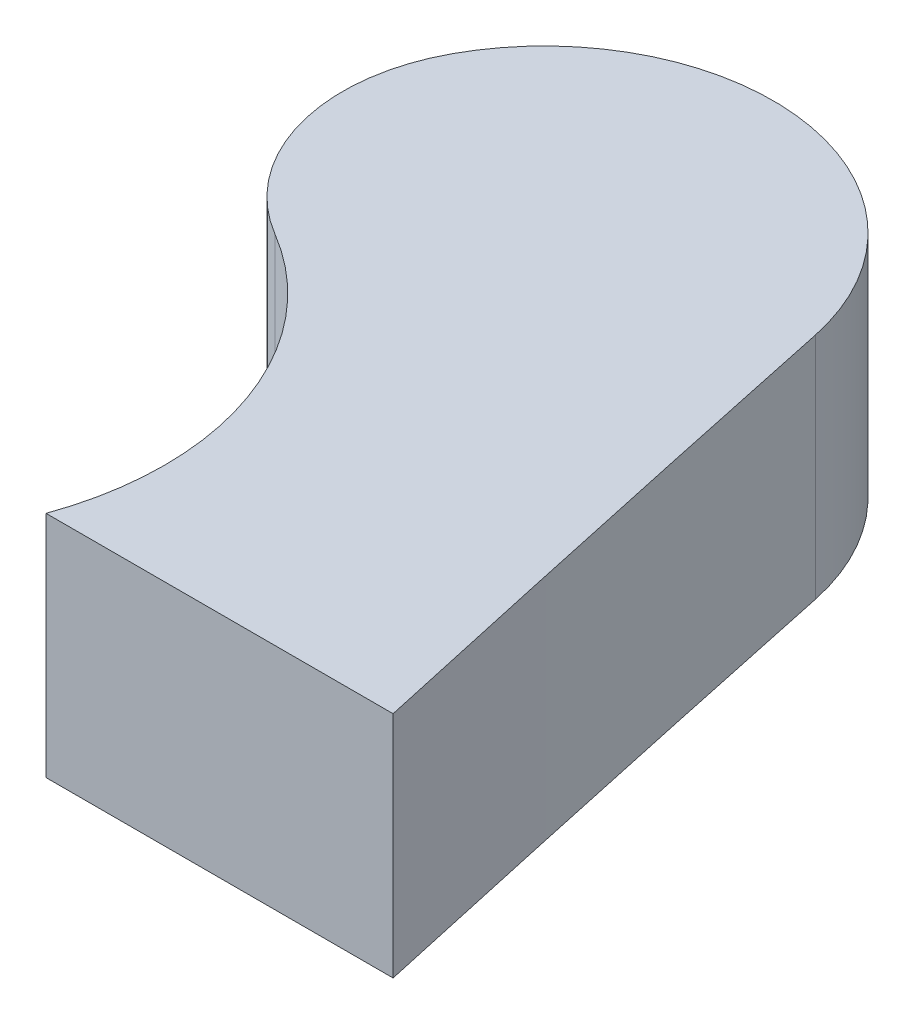
ISO-10303-21;
HEADER;
FILE_DESCRIPTION(('STEP AP214'),'2;1');
FILE_NAME('part.step','',(''),(''),'','','');
FILE_SCHEMA(('AUTOMOTIVE_DESIGN { 1 0 10303 214 1 1 1 1 }'));
ENDSEC;
DATA;
#1=APPLICATION_CONTEXT('core data for automotive mechanical design processes');
#2=APPLICATION_PROTOCOL_DEFINITION('international standard','automotive_design',2000,#1);
#3=PRODUCT_CONTEXT('',#1,'mechanical');
#4=PRODUCT('Part','Part','',(#3));
#5=PRODUCT_RELATED_PRODUCT_CATEGORY('part','',(#4));
#6=PRODUCT_DEFINITION_FORMATION('','',#4);
#7=PRODUCT_DEFINITION_CONTEXT('part definition',#1,'design');
#8=PRODUCT_DEFINITION('design','',#6,#7);
#9=PRODUCT_DEFINITION_SHAPE('','',#8);
#10=(LENGTH_UNIT() NAMED_UNIT(*) SI_UNIT(.MILLI.,.METRE.));
#11=(NAMED_UNIT(*) PLANE_ANGLE_UNIT() SI_UNIT($,.RADIAN.));
#12=(NAMED_UNIT(*) SI_UNIT($,.STERADIAN.) SOLID_ANGLE_UNIT());
#13=UNCERTAINTY_MEASURE_WITH_UNIT(LENGTH_MEASURE(1.E-05),#10,'distance_accuracy_value','');
#14=(GEOMETRIC_REPRESENTATION_CONTEXT(3) GLOBAL_UNCERTAINTY_ASSIGNED_CONTEXT((#13)) GLOBAL_UNIT_ASSIGNED_CONTEXT((#10,
#11,#12)) REPRESENTATION_CONTEXT('',''));
#15=CARTESIAN_POINT('',(0.,0.,0.));
#16=DIRECTION('',(0.,0.,1.));
#17=DIRECTION('',(1.,0.,0.));
#18=AXIS2_PLACEMENT_3D('',#15,#16,#17);
#19=CARTESIAN_POINT('',(0.,-71.0000047683717,-2.20684642442516E-13));
#20=DIRECTION('',(0.,1.,0.));
#21=DIRECTION('',(0.,0.,1.));
#22=AXIS2_PLACEMENT_3D('',#19,#20,#21);
#23=PLANE('',#22);
#24=DIRECTION('',(-1.,0.,0.));
#25=VECTOR('',#24,1.);
#26=CARTESIAN_POINT('',(2.01227923213309E-13,-71.0000047677994,-11.2500000000002));
#27=LINE('',#26,#25);
#28=CARTESIAN_POINT('',(7.44528645186782,-71.0000047677994,-11.2500000000003));
#29=VERTEX_POINT('',#28);
#30=CARTESIAN_POINT('',(-0.136071323830463,-71.0000047677988,-11.2500000000002));
#31=VERTEX_POINT('',#30);
#32=EDGE_CURVE('E60',#29,#31,#27,.T.);
#33=ORIENTED_EDGE('',*,*,#32,.T.);
#34=CARTESIAN_POINT('',(-6.2513343960096,-71.0000047677982,-13.4530791084396));
#35=DIRECTION('',(0.,1.,0.));
#36=DIRECTION('',(0.,0.,1.));
#37=AXIS2_PLACEMENT_3D('',#34,#35,#36);
#38=CIRCLE('',#37,6.5);
#39=CARTESIAN_POINT('',(-2.9261639666031,-71.0000047677983,-19.0381701207151));
#40=VERTEX_POINT('',#39);
#41=EDGE_CURVE('E20',#31,#40,#38,.T.);
#42=ORIENTED_EDGE('',*,*,#41,.T.);
#43=CARTESIAN_POINT('',(-0.879905240811327,-71.0000047677983,-22.4751492051904));
#44=DIRECTION('',(0.,1.,0.));
#45=DIRECTION('',(0.,0.,1.));
#46=AXIS2_PLACEMENT_3D('',#43,#44,#45);
#47=CIRCLE('',#46,4.);
#48=CARTESIAN_POINT('',(-4.39952620405566,-71.0000047677965,-24.3757460259525));
#49=VERTEX_POINT('',#48);
#50=EDGE_CURVE('E66',#49,#40,#47,.T.);
#51=ORIENTED_EDGE('',*,*,#50,.F.);
#52=CARTESIAN_POINT('',(-1.46471064301715E-13,-71.0000047677995,-22.));
#53=DIRECTION('',(0.,1.,0.));
#54=DIRECTION('',(0.,0.,1.));
#55=AXIS2_PLACEMENT_3D('',#52,#53,#54);
#56=CIRCLE('',#55,5.);
#57=CARTESIAN_POINT('',(4.89237093813955,-71.0000047677995,-23.0318462112329));
#58=VERTEX_POINT('',#57);
#59=EDGE_CURVE('E80',#58,#49,#56,.T.);
#60=ORIENTED_EDGE('',*,*,#59,.F.);
#61=CARTESIAN_POINT('',(1078.76136556438,-71.000004767803,-249.552556918456));
#62=DIRECTION('',(0.,1.,0.));
#63=DIRECTION('',(0.,0.,1.));
#64=AXIS2_PLACEMENT_3D('',#61,#62,#63);
#65=CIRCLE('',#64,1097.49999999949);
#66=EDGE_CURVE('E94',#58,#29,#65,.T.);
#67=ORIENTED_EDGE('',*,*,#66,.T.);
#68=EDGE_LOOP('',(#33,#42,#51,#60,#67));
#69=FACE_BOUND('',#68,.T.);
#70=ADVANCED_FACE('F17',(#69),#23,.F.);
#71=CARTESIAN_POINT('',(2.01227923213309E-13,-30.5433363392091,-11.2500000000001));
#72=DIRECTION('',(0.,0.,-1.));
#73=DIRECTION('',(-1.,0.,0.));
#74=AXIS2_PLACEMENT_3D('',#71,#72,#73);
#75=PLANE('',#74);
#76=DIRECTION('',(1.,0.,0.));
#77=VECTOR('',#76,1.);
#78=CARTESIAN_POINT('',(0.,-66.,-11.2500000000002));
#79=LINE('',#78,#77);
#80=CARTESIAN_POINT('',(7.44528645186771,-66.0000000000001,-11.2500000000004));
#81=VERTEX_POINT('',#80);
#82=CARTESIAN_POINT('',(-0.136071323830467,-66.,-11.2500000000002));
#83=VERTEX_POINT('',#82);
#84=EDGE_CURVE('E93',#81,#83,#79,.F.);
#85=ORIENTED_EDGE('',*,*,#84,.T.);
#86=DIRECTION('',(0.,1.,0.));
#87=VECTOR('',#86,1.);
#88=CARTESIAN_POINT('',(-0.136071323830452,-70.999999046326,-11.2500000000002));
#89=LINE('',#88,#87);
#90=EDGE_CURVE('E75',#83,#31,#89,.F.);
#91=ORIENTED_EDGE('',*,*,#90,.T.);
#92=ORIENTED_EDGE('',*,*,#32,.F.);
#93=DIRECTION('',(0.,1.,0.));
#94=VECTOR('',#93,1.);
#95=CARTESIAN_POINT('',(7.44528645186771,-70.999999046326,-11.2500000000005));
#96=LINE('',#95,#94);
#97=EDGE_CURVE('E95',#29,#81,#96,.T.);
#98=ORIENTED_EDGE('',*,*,#97,.T.);
#99=EDGE_LOOP('',(#85,#91,#92,#98));
#100=FACE_BOUND('',#99,.T.);
#101=ADVANCED_FACE('F103',(#100),#75,.F.);
#102=CARTESIAN_POINT('',(-6.2513343960096,-70.999999046326,-13.4530791084396));
#103=DIRECTION('',(0.,1.,0.));
#104=DIRECTION('',(0.,0.,1.));
#105=AXIS2_PLACEMENT_3D('',#102,#103,#104);
#106=CYLINDRICAL_SURFACE('',#105,6.5);
#107=ORIENTED_EDGE('',*,*,#90,.F.);
#108=CARTESIAN_POINT('',(-6.2513343960096,-65.9999999999999,-13.4530791084397));
#109=DIRECTION('',(0.,1.,0.));
#110=DIRECTION('',(0.,0.,1.));
#111=AXIS2_PLACEMENT_3D('',#108,#109,#110);
#112=CIRCLE('',#111,6.5);
#113=CARTESIAN_POINT('',(-2.9261639666031,-66.,-19.0381701207151));
#114=VERTEX_POINT('',#113);
#115=EDGE_CURVE('E79',#83,#114,#112,.T.);
#116=ORIENTED_EDGE('',*,*,#115,.T.);
#117=DIRECTION('',(0.,1.,0.));
#118=VECTOR('',#117,1.);
#119=CARTESIAN_POINT('',(-2.92616396660506,-70.9999990463261,-19.0381701207162));
#120=LINE('',#119,#118);
#121=EDGE_CURVE('E70',#40,#114,#120,.T.);
#122=ORIENTED_EDGE('',*,*,#121,.F.);
#123=ORIENTED_EDGE('',*,*,#41,.F.);
#124=EDGE_LOOP('',(#107,#116,#122,#123));
#125=FACE_BOUND('',#124,.T.);
#126=ADVANCED_FACE('F77',(#125),#106,.F.);
#127=CARTESIAN_POINT('',(-0.879905240811327,-70.9999990463261,-22.4751492051904));
#128=DIRECTION('',(0.,1.,0.));
#129=DIRECTION('',(0.,0.,1.));
#130=AXIS2_PLACEMENT_3D('',#127,#128,#129);
#131=CYLINDRICAL_SURFACE('',#130,4.);
#132=ORIENTED_EDGE('',*,*,#50,.T.);
#133=ORIENTED_EDGE('',*,*,#121,.T.);
#134=CARTESIAN_POINT('',(-0.879905240811326,-66.0000000000001,-22.4751492051905));
#135=DIRECTION('',(0.,1.,0.));
#136=DIRECTION('',(0.,0.,1.));
#137=AXIS2_PLACEMENT_3D('',#134,#135,#136);
#138=CIRCLE('',#137,4.);
#139=CARTESIAN_POINT('',(-4.39952620405566,-66.0000000000002,-24.3757460259525));
#140=VERTEX_POINT('',#139);
#141=EDGE_CURVE('E90',#114,#140,#138,.F.);
#142=ORIENTED_EDGE('',*,*,#141,.T.);
#143=DIRECTION('',(0.,1.,0.));
#144=VECTOR('',#143,1.);
#145=CARTESIAN_POINT('',(-4.39952620405539,-70.9999990463261,-24.3757460259529));
#146=LINE('',#145,#144);
#147=EDGE_CURVE('E72',#49,#140,#146,.T.);
#148=ORIENTED_EDGE('',*,*,#147,.F.);
#149=EDGE_LOOP('',(#132,#133,#142,#148));
#150=FACE_BOUND('',#149,.T.);
#151=ADVANCED_FACE('F67',(#150),#131,.T.);
#152=CARTESIAN_POINT('',(-1.46471063080155E-13,-70.9999990463261,-22.));
#153=DIRECTION('',(0.,1.,0.));
#154=DIRECTION('',(0.,0.,1.));
#155=AXIS2_PLACEMENT_3D('',#152,#153,#154);
#156=CYLINDRICAL_SURFACE('',#155,5.);
#157=ORIENTED_EDGE('',*,*,#59,.T.);
#158=ORIENTED_EDGE('',*,*,#147,.T.);
#159=CARTESIAN_POINT('',(-1.45403541145012E-13,-66.,-22.0000000000001));
#160=DIRECTION('',(0.,1.,0.));
#161=DIRECTION('',(0.,0.,1.));
#162=AXIS2_PLACEMENT_3D('',#159,#160,#161);
#163=CIRCLE('',#162,5.);
#164=CARTESIAN_POINT('',(4.89237093813855,-66.0000000000001,-23.0318462112327));
#165=VERTEX_POINT('',#164);
#166=EDGE_CURVE('E26',#140,#165,#163,.F.);
#167=ORIENTED_EDGE('',*,*,#166,.T.);
#168=DIRECTION('',(0.,1.,0.));
#169=VECTOR('',#168,1.);
#170=CARTESIAN_POINT('',(4.89237093813855,-70.9999990463261,-23.0318462112326));
#171=LINE('',#170,#169);
#172=EDGE_CURVE('E34',#165,#58,#171,.F.);
#173=ORIENTED_EDGE('',*,*,#172,.T.);
#174=EDGE_LOOP('',(#157,#158,#167,#173));
#175=FACE_BOUND('',#174,.T.);
#176=ADVANCED_FACE('F108',(#175),#156,.T.);
#177=CARTESIAN_POINT('',(1078.76136556438,-70.9999990463296,-249.552556918456));
#178=DIRECTION('',(0.,1.,0.));
#179=DIRECTION('',(0.,0.,1.));
#180=AXIS2_PLACEMENT_3D('',#177,#178,#179);
#181=CYLINDRICAL_SURFACE('',#180,1097.49999999949);
#182=ORIENTED_EDGE('',*,*,#97,.F.);
#183=ORIENTED_EDGE('',*,*,#66,.F.);
#184=ORIENTED_EDGE('',*,*,#172,.F.);
#185=CARTESIAN_POINT('',(1078.76136556438,-66.0000000000037,-249.552556918456));
#186=DIRECTION('',(0.,1.,0.));
#187=DIRECTION('',(0.,0.,1.));
#188=AXIS2_PLACEMENT_3D('',#185,#186,#187);
#189=CIRCLE('',#188,1097.49999999949);
#190=EDGE_CURVE('E11',#165,#81,#189,.T.);
#191=ORIENTED_EDGE('',*,*,#190,.T.);
#192=EDGE_LOOP('',(#182,#183,#184,#191));
#193=FACE_BOUND('',#192,.T.);
#194=ADVANCED_FACE('F109',(#193),#181,.F.);
#195=CARTESIAN_POINT('',(0.,-66.,-23.149994967554));
#196=DIRECTION('',(0.,-1.,0.));
#197=DIRECTION('',(0.,0.,-1.));
#198=AXIS2_PLACEMENT_3D('',#195,#196,#197);
#199=PLANE('',#198);
#200=ORIENTED_EDGE('',*,*,#166,.F.);
#201=ORIENTED_EDGE('',*,*,#141,.F.);
#202=ORIENTED_EDGE('',*,*,#115,.F.);
#203=ORIENTED_EDGE('',*,*,#84,.F.);
#204=ORIENTED_EDGE('',*,*,#190,.F.);
#205=EDGE_LOOP('',(#200,#201,#202,#203,#204));
#206=FACE_BOUND('',#205,.T.);
#207=ADVANCED_FACE('F107',(#206),#199,.F.);
#208=CLOSED_SHELL('',(#70,#101,#126,#151,#176,#194,#207));
#209=MANIFOLD_SOLID_BREP('B1',#208);
#210=ADVANCED_BREP_SHAPE_REPRESENTATION('',(#18,#209),#14);
#211=SHAPE_DEFINITION_REPRESENTATION(#9,#210);
ENDSEC;
END-ISO-10303-21;
